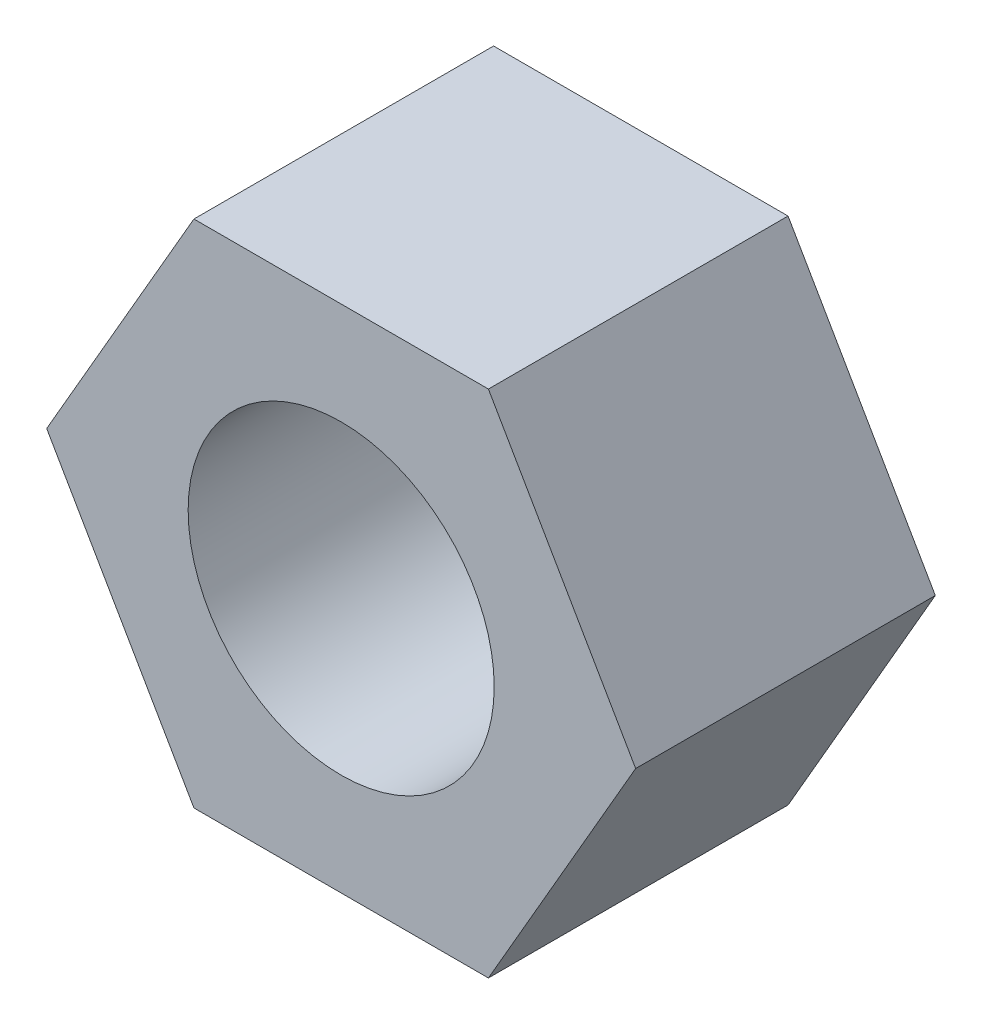
ISO-10303-21;
HEADER;
FILE_DESCRIPTION(('STEP AP214'),'2;1');
FILE_NAME('part.step','',(''),(''),'','','');
FILE_SCHEMA(('AUTOMOTIVE_DESIGN { 1 0 10303 214 1 1 1 1 }'));
ENDSEC;
DATA;
#1=APPLICATION_CONTEXT('core data for automotive mechanical design processes');
#2=APPLICATION_PROTOCOL_DEFINITION('international standard','automotive_design',2000,#1);
#3=PRODUCT_CONTEXT('',#1,'mechanical');
#4=PRODUCT('Part','Part','',(#3));
#5=PRODUCT_RELATED_PRODUCT_CATEGORY('part','',(#4));
#6=PRODUCT_DEFINITION_FORMATION('','',#4);
#7=PRODUCT_DEFINITION_CONTEXT('part definition',#1,'design');
#8=PRODUCT_DEFINITION('design','',#6,#7);
#9=PRODUCT_DEFINITION_SHAPE('','',#8);
#10=(LENGTH_UNIT() NAMED_UNIT(*) SI_UNIT(.MILLI.,.METRE.));
#11=(NAMED_UNIT(*) PLANE_ANGLE_UNIT() SI_UNIT($,.RADIAN.));
#12=(NAMED_UNIT(*) SI_UNIT($,.STERADIAN.) SOLID_ANGLE_UNIT());
#13=UNCERTAINTY_MEASURE_WITH_UNIT(LENGTH_MEASURE(1.E-05),#10,'distance_accuracy_value','');
#14=(GEOMETRIC_REPRESENTATION_CONTEXT(3) GLOBAL_UNCERTAINTY_ASSIGNED_CONTEXT((#13)) GLOBAL_UNIT_ASSIGNED_CONTEXT((#10,
#11,#12)) REPRESENTATION_CONTEXT('',''));
#15=CARTESIAN_POINT('',(0.,0.,0.));
#16=DIRECTION('',(0.,0.,1.));
#17=DIRECTION('',(1.,0.,0.));
#18=AXIS2_PLACEMENT_3D('',#15,#16,#17);
#19=CARTESIAN_POINT('',(2.30940107675851,-4.,2.35));
#20=DIRECTION('',(-0.866025403784439,0.5,0.));
#21=DIRECTION('',(-0.5,-0.866025403784439,0.));
#22=AXIS2_PLACEMENT_3D('',#19,#20,#21);
#23=PLANE('',#22);
#24=DIRECTION('',(0.5,0.866025403784439,0.));
#25=VECTOR('',#24,1.);
#26=CARTESIAN_POINT('',(2.30940107675851,-4.,-2.35));
#27=LINE('',#26,#25);
#28=CARTESIAN_POINT('',(2.30940107675851,-4.,-2.35));
#29=VERTEX_POINT('',#28);
#30=CARTESIAN_POINT('',(4.61880215351701,0.,-2.35));
#31=VERTEX_POINT('',#30);
#32=EDGE_CURVE('E118',#29,#31,#27,.T.);
#33=ORIENTED_EDGE('',*,*,#32,.T.);
#34=DIRECTION('',(0.,0.,-1.));
#35=VECTOR('',#34,1.);
#36=CARTESIAN_POINT('',(4.61880215351701,0.,2.35));
#37=LINE('',#36,#35);
#38=CARTESIAN_POINT('',(4.61880215351701,0.,2.35));
#39=VERTEX_POINT('',#38);
#40=EDGE_CURVE('E11',#39,#31,#37,.T.);
#41=ORIENTED_EDGE('',*,*,#40,.F.);
#42=DIRECTION('',(0.5,0.866025403784439,0.));
#43=VECTOR('',#42,1.);
#44=CARTESIAN_POINT('',(2.30940107675851,-4.,2.35));
#45=LINE('',#44,#43);
#46=CARTESIAN_POINT('',(2.30940107675851,-4.,2.35));
#47=VERTEX_POINT('',#46);
#48=EDGE_CURVE('E129',#47,#39,#45,.T.);
#49=ORIENTED_EDGE('',*,*,#48,.F.);
#50=DIRECTION('',(0.,0.,-1.));
#51=VECTOR('',#50,1.);
#52=CARTESIAN_POINT('',(2.30940107675851,-4.,2.35));
#53=LINE('',#52,#51);
#54=EDGE_CURVE('E114',#47,#29,#53,.T.);
#55=ORIENTED_EDGE('',*,*,#54,.T.);
#56=EDGE_LOOP('',(#33,#41,#49,#55));
#57=FACE_BOUND('',#56,.T.);
#58=ADVANCED_FACE('F34',(#57),#23,.F.);
#59=CARTESIAN_POINT('',(4.61880215351701,0.,2.35));
#60=DIRECTION('',(-0.866025403784438,-0.5,0.));
#61=DIRECTION('',(0.5,-0.866025403784438,0.));
#62=AXIS2_PLACEMENT_3D('',#59,#60,#61);
#63=PLANE('',#62);
#64=DIRECTION('',(-0.5,0.866025403784438,0.));
#65=VECTOR('',#64,1.);
#66=CARTESIAN_POINT('',(4.61880215351701,0.,-2.35));
#67=LINE('',#66,#65);
#68=CARTESIAN_POINT('',(2.3094010767585,4.,-2.35));
#69=VERTEX_POINT('',#68);
#70=EDGE_CURVE('E121',#31,#69,#67,.T.);
#71=ORIENTED_EDGE('',*,*,#70,.T.);
#72=DIRECTION('',(0.,0.,-1.));
#73=VECTOR('',#72,1.);
#74=CARTESIAN_POINT('',(2.3094010767585,4.,2.35));
#75=LINE('',#74,#73);
#76=CARTESIAN_POINT('',(2.3094010767585,4.,2.35));
#77=VERTEX_POINT('',#76);
#78=EDGE_CURVE('E42',#77,#69,#75,.T.);
#79=ORIENTED_EDGE('',*,*,#78,.F.);
#80=DIRECTION('',(-0.5,0.866025403784438,0.));
#81=VECTOR('',#80,1.);
#82=CARTESIAN_POINT('',(4.61880215351701,0.,2.35));
#83=LINE('',#82,#81);
#84=EDGE_CURVE('E87',#39,#77,#83,.T.);
#85=ORIENTED_EDGE('',*,*,#84,.F.);
#86=ORIENTED_EDGE('',*,*,#40,.T.);
#87=EDGE_LOOP('',(#71,#79,#85,#86));
#88=FACE_BOUND('',#87,.T.);
#89=ADVANCED_FACE('F154',(#88),#63,.F.);
#90=CARTESIAN_POINT('',(2.3094010767585,4.,2.35));
#91=DIRECTION('',(0.,-1.,0.));
#92=DIRECTION('',(0.,0.,-1.));
#93=AXIS2_PLACEMENT_3D('',#90,#91,#92);
#94=PLANE('',#93);
#95=DIRECTION('',(-1.,0.,0.));
#96=VECTOR('',#95,1.);
#97=CARTESIAN_POINT('',(2.3094010767585,4.,-2.35));
#98=LINE('',#97,#96);
#99=CARTESIAN_POINT('',(-2.3094010767585,4.,-2.35));
#100=VERTEX_POINT('',#99);
#101=EDGE_CURVE('E124',#69,#100,#98,.T.);
#102=ORIENTED_EDGE('',*,*,#101,.T.);
#103=DIRECTION('',(0.,0.,-1.));
#104=VECTOR('',#103,1.);
#105=CARTESIAN_POINT('',(-2.3094010767585,4.,2.35));
#106=LINE('',#105,#104);
#107=CARTESIAN_POINT('',(-2.3094010767585,4.,2.35));
#108=VERTEX_POINT('',#107);
#109=EDGE_CURVE('E109',#108,#100,#106,.T.);
#110=ORIENTED_EDGE('',*,*,#109,.F.);
#111=DIRECTION('',(-1.,0.,0.));
#112=VECTOR('',#111,1.);
#113=CARTESIAN_POINT('',(2.3094010767585,4.,2.35));
#114=LINE('',#113,#112);
#115=EDGE_CURVE('E100',#77,#108,#114,.T.);
#116=ORIENTED_EDGE('',*,*,#115,.F.);
#117=ORIENTED_EDGE('',*,*,#78,.T.);
#118=EDGE_LOOP('',(#102,#110,#116,#117));
#119=FACE_BOUND('',#118,.T.);
#120=ADVANCED_FACE('F135',(#119),#94,.F.);
#121=CARTESIAN_POINT('',(-2.3094010767585,4.,2.35));
#122=DIRECTION('',(0.866025403784439,-0.5,0.));
#123=DIRECTION('',(0.5,0.866025403784439,0.));
#124=AXIS2_PLACEMENT_3D('',#121,#122,#123);
#125=PLANE('',#124);
#126=DIRECTION('',(-0.5,-0.866025403784439,0.));
#127=VECTOR('',#126,1.);
#128=CARTESIAN_POINT('',(-2.3094010767585,4.,-2.35));
#129=LINE('',#128,#127);
#130=CARTESIAN_POINT('',(-4.61880215351701,0.,-2.35));
#131=VERTEX_POINT('',#130);
#132=EDGE_CURVE('E108',#100,#131,#129,.T.);
#133=ORIENTED_EDGE('',*,*,#132,.T.);
#134=DIRECTION('',(0.,0.,-1.));
#135=VECTOR('',#134,1.);
#136=CARTESIAN_POINT('',(-4.61880215351701,0.,2.35));
#137=LINE('',#136,#135);
#138=CARTESIAN_POINT('',(-4.61880215351701,0.,2.35));
#139=VERTEX_POINT('',#138);
#140=EDGE_CURVE('E105',#139,#131,#137,.T.);
#141=ORIENTED_EDGE('',*,*,#140,.F.);
#142=DIRECTION('',(-0.5,-0.866025403784439,0.));
#143=VECTOR('',#142,1.);
#144=CARTESIAN_POINT('',(-2.3094010767585,4.,2.35));
#145=LINE('',#144,#143);
#146=EDGE_CURVE('E94',#108,#139,#145,.T.);
#147=ORIENTED_EDGE('',*,*,#146,.F.);
#148=ORIENTED_EDGE('',*,*,#109,.T.);
#149=EDGE_LOOP('',(#133,#141,#147,#148));
#150=FACE_BOUND('',#149,.T.);
#151=ADVANCED_FACE('F106',(#150),#125,.F.);
#152=CARTESIAN_POINT('',(-4.61880215351701,0.,2.35));
#153=DIRECTION('',(0.866025403784439,0.5,0.));
#154=DIRECTION('',(-0.5,0.866025403784439,0.));
#155=AXIS2_PLACEMENT_3D('',#152,#153,#154);
#156=PLANE('',#155);
#157=DIRECTION('',(0.5,-0.866025403784438,0.));
#158=VECTOR('',#157,1.);
#159=CARTESIAN_POINT('',(-4.61880215351701,0.,-2.35));
#160=LINE('',#159,#158);
#161=CARTESIAN_POINT('',(-2.3094010767585,-4.,-2.35));
#162=VERTEX_POINT('',#161);
#163=EDGE_CURVE('E73',#131,#162,#160,.T.);
#164=ORIENTED_EDGE('',*,*,#163,.T.);
#165=DIRECTION('',(0.,0.,-1.));
#166=VECTOR('',#165,1.);
#167=CARTESIAN_POINT('',(-2.3094010767585,-4.,2.35));
#168=LINE('',#167,#166);
#169=CARTESIAN_POINT('',(-2.3094010767585,-4.,2.35));
#170=VERTEX_POINT('',#169);
#171=EDGE_CURVE('E110',#170,#162,#168,.T.);
#172=ORIENTED_EDGE('',*,*,#171,.F.);
#173=DIRECTION('',(0.5,-0.866025403784438,0.));
#174=VECTOR('',#173,1.);
#175=CARTESIAN_POINT('',(-4.61880215351701,0.,2.35));
#176=LINE('',#175,#174);
#177=EDGE_CURVE('E98',#139,#170,#176,.T.);
#178=ORIENTED_EDGE('',*,*,#177,.F.);
#179=ORIENTED_EDGE('',*,*,#140,.T.);
#180=EDGE_LOOP('',(#164,#172,#178,#179));
#181=FACE_BOUND('',#180,.T.);
#182=ADVANCED_FACE('F112',(#181),#156,.F.);
#183=CARTESIAN_POINT('',(-2.3094010767585,-4.,2.35));
#184=DIRECTION('',(0.,1.,0.));
#185=DIRECTION('',(0.,0.,1.));
#186=AXIS2_PLACEMENT_3D('',#183,#184,#185);
#187=PLANE('',#186);
#188=DIRECTION('',(1.,0.,0.));
#189=VECTOR('',#188,1.);
#190=CARTESIAN_POINT('',(-2.3094010767585,-4.,-2.35));
#191=LINE('',#190,#189);
#192=EDGE_CURVE('E79',#162,#29,#191,.T.);
#193=ORIENTED_EDGE('',*,*,#192,.T.);
#194=ORIENTED_EDGE('',*,*,#54,.F.);
#195=DIRECTION('',(1.,0.,0.));
#196=VECTOR('',#195,1.);
#197=CARTESIAN_POINT('',(-2.3094010767585,-4.,2.35));
#198=LINE('',#197,#196);
#199=EDGE_CURVE('E50',#170,#47,#198,.T.);
#200=ORIENTED_EDGE('',*,*,#199,.F.);
#201=ORIENTED_EDGE('',*,*,#171,.T.);
#202=EDGE_LOOP('',(#193,#194,#200,#201));
#203=FACE_BOUND('',#202,.T.);
#204=ADVANCED_FACE('F142',(#203),#187,.F.);
#205=CARTESIAN_POINT('',(0.,0.,2.35));
#206=DIRECTION('',(0.,0.,1.));
#207=DIRECTION('',(1.,0.,0.));
#208=AXIS2_PLACEMENT_3D('',#205,#206,#207);
#209=PLANE('',#208);
#210=CARTESIAN_POINT('',(0.,0.,2.35));
#211=DIRECTION('',(0.,0.,1.));
#212=DIRECTION('',(1.,0.,0.));
#213=AXIS2_PLACEMENT_3D('',#210,#211,#212);
#214=CIRCLE('',#213,2.4);
#215=CARTESIAN_POINT('',(2.4,0.,2.35));
#216=VERTEX_POINT('',#215);
#217=EDGE_CURVE('E209',#216,#216,#214,.T.);
#218=ORIENTED_EDGE('',*,*,#217,.F.);
#219=EDGE_LOOP('',(#218));
#220=FACE_BOUND('',#219,.T.);
#221=ORIENTED_EDGE('',*,*,#48,.T.);
#222=ORIENTED_EDGE('',*,*,#84,.T.);
#223=ORIENTED_EDGE('',*,*,#115,.T.);
#224=ORIENTED_EDGE('',*,*,#146,.T.);
#225=ORIENTED_EDGE('',*,*,#177,.T.);
#226=ORIENTED_EDGE('',*,*,#199,.T.);
#227=EDGE_LOOP('',(#221,#222,#223,#224,#225,#226));
#228=FACE_BOUND('',#227,.T.);
#229=ADVANCED_FACE('F96',(#220,#228),#209,.T.);
#230=CARTESIAN_POINT('',(0.,0.,-2.35));
#231=DIRECTION('',(0.,0.,1.));
#232=DIRECTION('',(1.,0.,0.));
#233=AXIS2_PLACEMENT_3D('',#230,#231,#232);
#234=PLANE('',#233);
#235=CARTESIAN_POINT('',(0.,0.,-2.35));
#236=DIRECTION('',(0.,0.,1.));
#237=DIRECTION('',(1.,0.,0.));
#238=AXIS2_PLACEMENT_3D('',#235,#236,#237);
#239=CIRCLE('',#238,2.4);
#240=CARTESIAN_POINT('',(2.4,0.,-2.35));
#241=VERTEX_POINT('',#240);
#242=EDGE_CURVE('E122',#241,#241,#239,.T.);
#243=ORIENTED_EDGE('',*,*,#242,.T.);
#244=EDGE_LOOP('',(#243));
#245=FACE_BOUND('',#244,.T.);
#246=ORIENTED_EDGE('',*,*,#32,.F.);
#247=ORIENTED_EDGE('',*,*,#192,.F.);
#248=ORIENTED_EDGE('',*,*,#163,.F.);
#249=ORIENTED_EDGE('',*,*,#132,.F.);
#250=ORIENTED_EDGE('',*,*,#101,.F.);
#251=ORIENTED_EDGE('',*,*,#70,.F.);
#252=EDGE_LOOP('',(#246,#247,#248,#249,#250,#251));
#253=FACE_BOUND('',#252,.T.);
#254=ADVANCED_FACE('F138',(#245,#253),#234,.F.);
#255=CARTESIAN_POINT('',(0.,0.,-2.35));
#256=DIRECTION('',(0.,0.,1.));
#257=DIRECTION('',(1.,0.,0.));
#258=AXIS2_PLACEMENT_3D('',#255,#256,#257);
#259=CYLINDRICAL_SURFACE('',#258,2.4);
#260=ORIENTED_EDGE('',*,*,#242,.F.);
#261=EDGE_LOOP('',(#260));
#262=FACE_BOUND('',#261,.T.);
#263=ORIENTED_EDGE('',*,*,#217,.T.);
#264=EDGE_LOOP('',(#263));
#265=FACE_BOUND('',#264,.T.);
#266=ADVANCED_FACE('F191',(#262,#265),#259,.F.);
#267=CLOSED_SHELL('',(#58,#89,#120,#151,#182,#204,#229,#254,#266));
#268=MANIFOLD_SOLID_BREP('B2',#267);
#269=ADVANCED_BREP_SHAPE_REPRESENTATION('',(#18,#268),#14);
#270=SHAPE_DEFINITION_REPRESENTATION(#9,#269);
ENDSEC;
END-ISO-10303-21;
